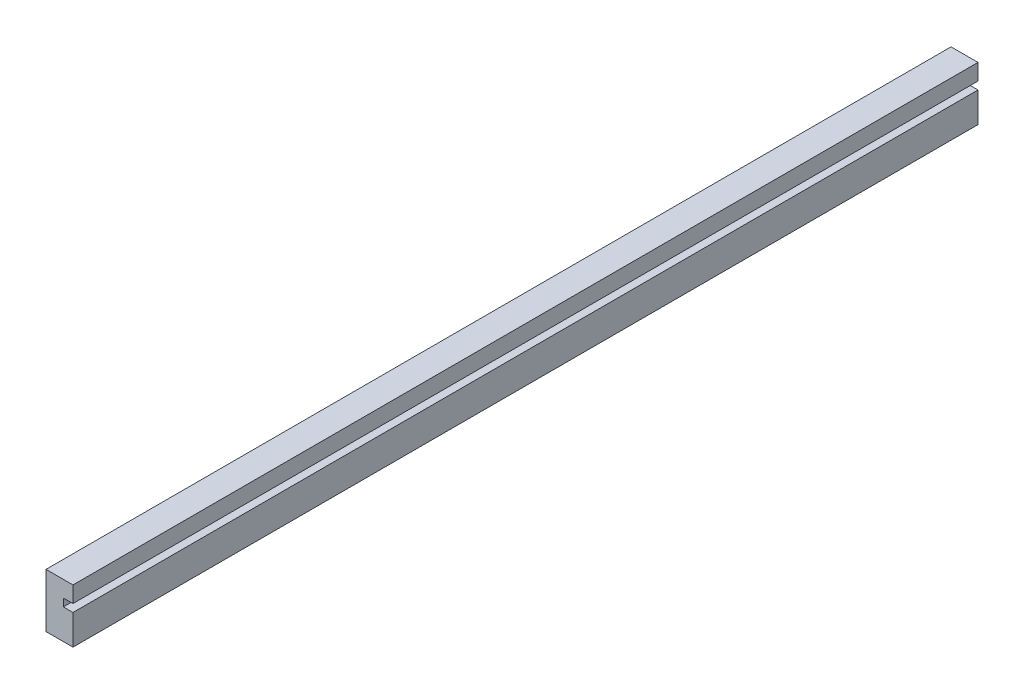
ISO-10303-21;
HEADER;
FILE_DESCRIPTION(('STEP AP214'),'2;1');
FILE_NAME('part.step','',(''),(''),'','','');
FILE_SCHEMA(('AUTOMOTIVE_DESIGN { 1 0 10303 214 1 1 1 1 }'));
ENDSEC;
DATA;
#1=APPLICATION_CONTEXT('core data for automotive mechanical design processes');
#2=APPLICATION_PROTOCOL_DEFINITION('international standard','automotive_design',2000,#1);
#3=PRODUCT_CONTEXT('',#1,'mechanical');
#4=PRODUCT('Part','Part','',(#3));
#5=PRODUCT_RELATED_PRODUCT_CATEGORY('part','',(#4));
#6=PRODUCT_DEFINITION_FORMATION('','',#4);
#7=PRODUCT_DEFINITION_CONTEXT('part definition',#1,'design');
#8=PRODUCT_DEFINITION('design','',#6,#7);
#9=PRODUCT_DEFINITION_SHAPE('','',#8);
#10=(LENGTH_UNIT() NAMED_UNIT(*) SI_UNIT(.MILLI.,.METRE.));
#11=(NAMED_UNIT(*) PLANE_ANGLE_UNIT() SI_UNIT($,.RADIAN.));
#12=(NAMED_UNIT(*) SI_UNIT($,.STERADIAN.) SOLID_ANGLE_UNIT());
#13=UNCERTAINTY_MEASURE_WITH_UNIT(LENGTH_MEASURE(1.E-05),#10,'distance_accuracy_value','');
#14=(GEOMETRIC_REPRESENTATION_CONTEXT(3) GLOBAL_UNCERTAINTY_ASSIGNED_CONTEXT((#13)) GLOBAL_UNIT_ASSIGNED_CONTEXT((#10,
#11,#12)) REPRESENTATION_CONTEXT('',''));
#15=CARTESIAN_POINT('',(0.,0.,0.));
#16=DIRECTION('',(0.,0.,1.));
#17=DIRECTION('',(1.,0.,0.));
#18=AXIS2_PLACEMENT_3D('',#15,#16,#17);
#19=CARTESIAN_POINT('',(0.,7.,0.));
#20=DIRECTION('',(0.,1.,0.));
#21=DIRECTION('',(0.,0.,1.));
#22=AXIS2_PLACEMENT_3D('',#19,#20,#21);
#23=PLANE('',#22);
#24=CARTESIAN_POINT('',(-3.,7.,-212.5));
#25=DIRECTION('',(0.,1.,0.));
#26=DIRECTION('',(0.,0.,1.));
#27=AXIS2_PLACEMENT_3D('',#24,#25,#26);
#28=CIRCLE('',#27,1.2);
#29=CARTESIAN_POINT('',(-3.,7.,-211.3));
#30=VERTEX_POINT('',#29);
#31=EDGE_CURVE('E19',#30,#30,#28,.F.);
#32=ORIENTED_EDGE('',*,*,#31,.T.);
#33=EDGE_LOOP('',(#32));
#34=FACE_BOUND('',#33,.T.);
#35=ADVANCED_FACE('F16',(#34),#23,.F.);
#36=CARTESIAN_POINT('',(0.,7.,0.));
#37=DIRECTION('',(0.,1.,0.));
#38=DIRECTION('',(0.,0.,1.));
#39=AXIS2_PLACEMENT_3D('',#36,#37,#38);
#40=PLANE('',#39);
#41=CARTESIAN_POINT('',(-3.,7.,-122.5));
#42=DIRECTION('',(0.,1.,0.));
#43=DIRECTION('',(0.,0.,1.));
#44=AXIS2_PLACEMENT_3D('',#41,#42,#43);
#45=CIRCLE('',#44,1.2);
#46=CARTESIAN_POINT('',(-3.,7.,-121.3));
#47=VERTEX_POINT('',#46);
#48=EDGE_CURVE('E132',#47,#47,#45,.F.);
#49=ORIENTED_EDGE('',*,*,#48,.T.);
#50=EDGE_LOOP('',(#49));
#51=FACE_BOUND('',#50,.T.);
#52=ADVANCED_FACE('F311',(#51),#40,.F.);
#53=CARTESIAN_POINT('',(0.,7.,0.));
#54=DIRECTION('',(0.,1.,0.));
#55=DIRECTION('',(0.,0.,1.));
#56=AXIS2_PLACEMENT_3D('',#53,#54,#55);
#57=PLANE('',#56);
#58=CARTESIAN_POINT('',(-3.,7.,-32.5));
#59=DIRECTION('',(0.,1.,0.));
#60=DIRECTION('',(0.,0.,1.));
#61=AXIS2_PLACEMENT_3D('',#58,#59,#60);
#62=CIRCLE('',#61,1.2);
#63=CARTESIAN_POINT('',(-3.,7.,-31.3));
#64=VERTEX_POINT('',#63);
#65=EDGE_CURVE('E123',#64,#64,#62,.F.);
#66=ORIENTED_EDGE('',*,*,#65,.T.);
#67=EDGE_LOOP('',(#66));
#68=FACE_BOUND('',#67,.T.);
#69=ADVANCED_FACE('F144',(#68),#57,.F.);
#70=CARTESIAN_POINT('',(-3.,0.,-212.5));
#71=DIRECTION('',(0.,1.,0.));
#72=DIRECTION('',(0.,0.,1.));
#73=AXIS2_PLACEMENT_3D('',#70,#71,#72);
#74=CYLINDRICAL_SURFACE('',#73,1.2);
#75=ORIENTED_EDGE('',*,*,#31,.F.);
#76=EDGE_LOOP('',(#75));
#77=FACE_BOUND('',#76,.T.);
#78=CARTESIAN_POINT('',(-3.,0.,-212.5));
#79=DIRECTION('',(0.,1.,0.));
#80=DIRECTION('',(0.,0.,1.));
#81=AXIS2_PLACEMENT_3D('',#78,#79,#80);
#82=CIRCLE('',#81,1.2);
#83=CARTESIAN_POINT('',(-3.,0.,-211.3));
#84=VERTEX_POINT('',#83);
#85=EDGE_CURVE('E116',#84,#84,#82,.T.);
#86=ORIENTED_EDGE('',*,*,#85,.F.);
#87=EDGE_LOOP('',(#86));
#88=FACE_BOUND('',#87,.T.);
#89=ADVANCED_FACE('F140',(#77,#88),#74,.F.);
#90=CARTESIAN_POINT('',(-3.,0.,-122.5));
#91=DIRECTION('',(0.,1.,0.));
#92=DIRECTION('',(0.,0.,1.));
#93=AXIS2_PLACEMENT_3D('',#90,#91,#92);
#94=CYLINDRICAL_SURFACE('',#93,1.2);
#95=ORIENTED_EDGE('',*,*,#48,.F.);
#96=EDGE_LOOP('',(#95));
#97=FACE_BOUND('',#96,.T.);
#98=CARTESIAN_POINT('',(-3.,0.,-122.5));
#99=DIRECTION('',(0.,1.,0.));
#100=DIRECTION('',(0.,0.,1.));
#101=AXIS2_PLACEMENT_3D('',#98,#99,#100);
#102=CIRCLE('',#101,1.2);
#103=CARTESIAN_POINT('',(-3.,0.,-121.3));
#104=VERTEX_POINT('',#103);
#105=EDGE_CURVE('E126',#104,#104,#102,.T.);
#106=ORIENTED_EDGE('',*,*,#105,.F.);
#107=EDGE_LOOP('',(#106));
#108=FACE_BOUND('',#107,.T.);
#109=ADVANCED_FACE('F143',(#97,#108),#94,.F.);
#110=CARTESIAN_POINT('',(-3.,0.,-32.5));
#111=DIRECTION('',(0.,1.,0.));
#112=DIRECTION('',(0.,0.,1.));
#113=AXIS2_PLACEMENT_3D('',#110,#111,#112);
#114=CYLINDRICAL_SURFACE('',#113,1.2);
#115=ORIENTED_EDGE('',*,*,#65,.F.);
#116=EDGE_LOOP('',(#115));
#117=FACE_BOUND('',#116,.T.);
#118=CARTESIAN_POINT('',(-3.,0.,-32.5));
#119=DIRECTION('',(0.,1.,0.));
#120=DIRECTION('',(0.,0.,1.));
#121=AXIS2_PLACEMENT_3D('',#118,#119,#120);
#122=CIRCLE('',#121,1.2);
#123=CARTESIAN_POINT('',(-3.,0.,-31.3));
#124=VERTEX_POINT('',#123);
#125=EDGE_CURVE('E102',#124,#124,#122,.T.);
#126=ORIENTED_EDGE('',*,*,#125,.F.);
#127=EDGE_LOOP('',(#126));
#128=FACE_BOUND('',#127,.T.);
#129=ADVANCED_FACE('F206',(#117,#128),#114,.F.);
#130=CARTESIAN_POINT('',(0.,7.8,0.));
#131=DIRECTION('',(0.,1.,0.));
#132=DIRECTION('',(0.,0.,1.));
#133=AXIS2_PLACEMENT_3D('',#130,#131,#132);
#134=PLANE('',#133);
#135=DIRECTION('',(0.,0.,-1.));
#136=VECTOR('',#135,1.);
#137=CARTESIAN_POINT('',(0.,7.8,0.));
#138=LINE('',#137,#136);
#139=CARTESIAN_POINT('',(0.,7.8,-240.));
#140=VERTEX_POINT('',#139);
#141=CARTESIAN_POINT('',(0.,7.8,-5.));
#142=VERTEX_POINT('',#141);
#143=EDGE_CURVE('E94',#140,#142,#138,.F.);
#144=ORIENTED_EDGE('',*,*,#143,.F.);
#145=DIRECTION('',(1.,0.,0.));
#146=VECTOR('',#145,1.);
#147=CARTESIAN_POINT('',(0.,7.8,-240.));
#148=LINE('',#147,#146);
#149=CARTESIAN_POINT('',(-2.5,7.8,-240.));
#150=VERTEX_POINT('',#149);
#151=EDGE_CURVE('E184',#140,#150,#148,.F.);
#152=ORIENTED_EDGE('',*,*,#151,.T.);
#153=DIRECTION('',(0.,0.,-1.));
#154=VECTOR('',#153,1.);
#155=CARTESIAN_POINT('',(-2.5,7.8,0.));
#156=LINE('',#155,#154);
#157=CARTESIAN_POINT('',(-2.5,7.8,-5.));
#158=VERTEX_POINT('',#157);
#159=EDGE_CURVE('E120',#158,#150,#156,.T.);
#160=ORIENTED_EDGE('',*,*,#159,.F.);
#161=DIRECTION('',(-1.,0.,0.));
#162=VECTOR('',#161,1.);
#163=CARTESIAN_POINT('',(-7.,7.8,-5.));
#164=LINE('',#163,#162);
#165=EDGE_CURVE('E109',#158,#142,#164,.F.);
#166=ORIENTED_EDGE('',*,*,#165,.T.);
#167=EDGE_LOOP('',(#144,#152,#160,#166));
#168=FACE_BOUND('',#167,.T.);
#169=ADVANCED_FACE('F192',(#168),#134,.T.);
#170=CARTESIAN_POINT('',(-2.5,7.8,0.));
#171=DIRECTION('',(1.,0.,0.));
#172=DIRECTION('',(0.,0.,-1.));
#173=AXIS2_PLACEMENT_3D('',#170,#171,#172);
#174=PLANE('',#173);
#175=ORIENTED_EDGE('',*,*,#159,.T.);
#176=DIRECTION('',(0.,1.,0.));
#177=VECTOR('',#176,1.);
#178=CARTESIAN_POINT('',(-2.5,0.,-240.));
#179=LINE('',#178,#177);
#180=CARTESIAN_POINT('',(-2.5,9.8,-240.));
#181=VERTEX_POINT('',#180);
#182=EDGE_CURVE('E182',#150,#181,#179,.T.);
#183=ORIENTED_EDGE('',*,*,#182,.T.);
#184=DIRECTION('',(0.,0.,-1.));
#185=VECTOR('',#184,1.);
#186=CARTESIAN_POINT('',(-2.5,9.8,0.));
#187=LINE('',#186,#185);
#188=CARTESIAN_POINT('',(-2.5,9.8,-5.));
#189=VERTEX_POINT('',#188);
#190=EDGE_CURVE('E79',#189,#181,#187,.T.);
#191=ORIENTED_EDGE('',*,*,#190,.F.);
#192=DIRECTION('',(0.,1.,0.));
#193=VECTOR('',#192,1.);
#194=CARTESIAN_POINT('',(-2.5,0.,-5.));
#195=LINE('',#194,#193);
#196=EDGE_CURVE('E107',#189,#158,#195,.F.);
#197=ORIENTED_EDGE('',*,*,#196,.T.);
#198=EDGE_LOOP('',(#175,#183,#191,#197));
#199=FACE_BOUND('',#198,.T.);
#200=ADVANCED_FACE('F197',(#199),#174,.T.);
#201=CARTESIAN_POINT('',(-2.5,9.8,0.));
#202=DIRECTION('',(0.,-1.,0.));
#203=DIRECTION('',(0.,0.,-1.));
#204=AXIS2_PLACEMENT_3D('',#201,#202,#203);
#205=PLANE('',#204);
#206=ORIENTED_EDGE('',*,*,#190,.T.);
#207=DIRECTION('',(1.,0.,0.));
#208=VECTOR('',#207,1.);
#209=CARTESIAN_POINT('',(0.,9.8,-240.));
#210=LINE('',#209,#208);
#211=CARTESIAN_POINT('',(0.,9.8,-240.));
#212=VERTEX_POINT('',#211);
#213=EDGE_CURVE('E91',#181,#212,#210,.T.);
#214=ORIENTED_EDGE('',*,*,#213,.T.);
#215=DIRECTION('',(0.,0.,-1.));
#216=VECTOR('',#215,1.);
#217=CARTESIAN_POINT('',(0.,9.8,0.));
#218=LINE('',#217,#216);
#219=CARTESIAN_POINT('',(0.,9.8,-5.));
#220=VERTEX_POINT('',#219);
#221=EDGE_CURVE('E84',#220,#212,#218,.T.);
#222=ORIENTED_EDGE('',*,*,#221,.F.);
#223=DIRECTION('',(-1.,0.,0.));
#224=VECTOR('',#223,1.);
#225=CARTESIAN_POINT('',(-7.,9.8,-5.));
#226=LINE('',#225,#224);
#227=EDGE_CURVE('E88',#220,#189,#226,.T.);
#228=ORIENTED_EDGE('',*,*,#227,.T.);
#229=EDGE_LOOP('',(#206,#214,#222,#228));
#230=FACE_BOUND('',#229,.T.);
#231=ADVANCED_FACE('F86',(#230),#205,.T.);
#232=CARTESIAN_POINT('',(0.,9.8,0.));
#233=DIRECTION('',(1.,0.,0.));
#234=DIRECTION('',(0.,0.,-1.));
#235=AXIS2_PLACEMENT_3D('',#232,#233,#234);
#236=PLANE('',#235);
#237=ORIENTED_EDGE('',*,*,#221,.T.);
#238=DIRECTION('',(0.,1.,0.));
#239=VECTOR('',#238,1.);
#240=CARTESIAN_POINT('',(0.,0.,-240.));
#241=LINE('',#240,#239);
#242=CARTESIAN_POINT('',(0.,14.,-240.));
#243=VERTEX_POINT('',#242);
#244=EDGE_CURVE('E179',#212,#243,#241,.T.);
#245=ORIENTED_EDGE('',*,*,#244,.T.);
#246=DIRECTION('',(0.,0.,1.));
#247=VECTOR('',#246,1.);
#248=CARTESIAN_POINT('',(0.,14.,0.));
#249=LINE('',#248,#247);
#250=CARTESIAN_POINT('',(0.,14.,-5.));
#251=VERTEX_POINT('',#250);
#252=EDGE_CURVE('E99',#251,#243,#249,.F.);
#253=ORIENTED_EDGE('',*,*,#252,.F.);
#254=DIRECTION('',(0.,1.,0.));
#255=VECTOR('',#254,1.);
#256=CARTESIAN_POINT('',(0.,0.,-5.));
#257=LINE('',#256,#255);
#258=EDGE_CURVE('E97',#251,#220,#257,.F.);
#259=ORIENTED_EDGE('',*,*,#258,.T.);
#260=EDGE_LOOP('',(#237,#245,#253,#259));
#261=FACE_BOUND('',#260,.T.);
#262=ADVANCED_FACE('F98',(#261),#236,.T.);
#263=CARTESIAN_POINT('',(0.,0.,0.));
#264=DIRECTION('',(1.,0.,0.));
#265=DIRECTION('',(0.,0.,-1.));
#266=AXIS2_PLACEMENT_3D('',#263,#264,#265);
#267=PLANE('',#266);
#268=DIRECTION('',(0.,0.,-1.));
#269=VECTOR('',#268,1.);
#270=CARTESIAN_POINT('',(0.,0.,0.));
#271=LINE('',#270,#269);
#272=CARTESIAN_POINT('',(0.,0.,-240.));
#273=VERTEX_POINT('',#272);
#274=CARTESIAN_POINT('',(0.,0.,-5.));
#275=VERTEX_POINT('',#274);
#276=EDGE_CURVE('E113',#273,#275,#271,.F.);
#277=ORIENTED_EDGE('',*,*,#276,.F.);
#278=DIRECTION('',(0.,1.,0.));
#279=VECTOR('',#278,1.);
#280=CARTESIAN_POINT('',(0.,0.,-240.));
#281=LINE('',#280,#279);
#282=EDGE_CURVE('E165',#273,#140,#281,.T.);
#283=ORIENTED_EDGE('',*,*,#282,.T.);
#284=ORIENTED_EDGE('',*,*,#143,.T.);
#285=DIRECTION('',(0.,1.,0.));
#286=VECTOR('',#285,1.);
#287=CARTESIAN_POINT('',(0.,0.,-5.));
#288=LINE('',#287,#286);
#289=EDGE_CURVE('E190',#142,#275,#288,.F.);
#290=ORIENTED_EDGE('',*,*,#289,.T.);
#291=EDGE_LOOP('',(#277,#283,#284,#290));
#292=FACE_BOUND('',#291,.T.);
#293=ADVANCED_FACE('F151',(#292),#267,.T.);
#294=CARTESIAN_POINT('',(-7.,0.,0.));
#295=DIRECTION('',(0.,-1.,0.));
#296=DIRECTION('',(0.,0.,-1.));
#297=AXIS2_PLACEMENT_3D('',#294,#295,#296);
#298=PLANE('',#297);
#299=ORIENTED_EDGE('',*,*,#125,.T.);
#300=EDGE_LOOP('',(#299));
#301=FACE_BOUND('',#300,.T.);
#302=ORIENTED_EDGE('',*,*,#105,.T.);
#303=EDGE_LOOP('',(#302));
#304=FACE_BOUND('',#303,.T.);
#305=ORIENTED_EDGE('',*,*,#85,.T.);
#306=EDGE_LOOP('',(#305));
#307=FACE_BOUND('',#306,.T.);
#308=DIRECTION('',(0.,0.,1.));
#309=VECTOR('',#308,1.);
#310=CARTESIAN_POINT('',(-7.,0.,0.));
#311=LINE('',#310,#309);
#312=CARTESIAN_POINT('',(-7.,0.,-240.));
#313=VERTEX_POINT('',#312);
#314=CARTESIAN_POINT('',(-7.,0.,-5.));
#315=VERTEX_POINT('',#314);
#316=EDGE_CURVE('E156',#313,#315,#311,.T.);
#317=ORIENTED_EDGE('',*,*,#316,.F.);
#318=DIRECTION('',(1.,0.,0.));
#319=VECTOR('',#318,1.);
#320=CARTESIAN_POINT('',(0.,0.,-240.));
#321=LINE('',#320,#319);
#322=EDGE_CURVE('E158',#313,#273,#321,.T.);
#323=ORIENTED_EDGE('',*,*,#322,.T.);
#324=ORIENTED_EDGE('',*,*,#276,.T.);
#325=DIRECTION('',(-1.,0.,0.));
#326=VECTOR('',#325,1.);
#327=CARTESIAN_POINT('',(-7.,0.,-5.));
#328=LINE('',#327,#326);
#329=EDGE_CURVE('E160',#275,#315,#328,.T.);
#330=ORIENTED_EDGE('',*,*,#329,.T.);
#331=EDGE_LOOP('',(#317,#323,#324,#330));
#332=FACE_BOUND('',#331,.T.);
#333=ADVANCED_FACE('F148',(#301,#304,#307,#332),#298,.T.);
#334=CARTESIAN_POINT('',(-7.,0.,-5.));
#335=DIRECTION('',(0.,0.,-1.));
#336=DIRECTION('',(-1.,0.,0.));
#337=AXIS2_PLACEMENT_3D('',#334,#335,#336);
#338=PLANE('',#337);
#339=ORIENTED_EDGE('',*,*,#329,.F.);
#340=ORIENTED_EDGE('',*,*,#289,.F.);
#341=ORIENTED_EDGE('',*,*,#165,.F.);
#342=ORIENTED_EDGE('',*,*,#196,.F.);
#343=ORIENTED_EDGE('',*,*,#227,.F.);
#344=ORIENTED_EDGE('',*,*,#258,.F.);
#345=DIRECTION('',(1.,0.,0.));
#346=VECTOR('',#345,1.);
#347=CARTESIAN_POINT('',(0.,14.,-5.));
#348=LINE('',#347,#346);
#349=CARTESIAN_POINT('',(-7.,14.,-5.));
#350=VERTEX_POINT('',#349);
#351=EDGE_CURVE('E187',#350,#251,#348,.T.);
#352=ORIENTED_EDGE('',*,*,#351,.F.);
#353=DIRECTION('',(0.,1.,0.));
#354=VECTOR('',#353,1.);
#355=CARTESIAN_POINT('',(-7.,14.,-5.));
#356=LINE('',#355,#354);
#357=EDGE_CURVE('E164',#315,#350,#356,.T.);
#358=ORIENTED_EDGE('',*,*,#357,.F.);
#359=EDGE_LOOP('',(#339,#340,#341,#342,#343,#344,#352,#358));
#360=FACE_BOUND('',#359,.T.);
#361=ADVANCED_FACE('F105',(#360),#338,.F.);
#362=CARTESIAN_POINT('',(0.,14.,0.));
#363=DIRECTION('',(0.,1.,0.));
#364=DIRECTION('',(0.,0.,1.));
#365=AXIS2_PLACEMENT_3D('',#362,#363,#364);
#366=PLANE('',#365);
#367=ORIENTED_EDGE('',*,*,#252,.T.);
#368=DIRECTION('',(1.,0.,0.));
#369=VECTOR('',#368,1.);
#370=CARTESIAN_POINT('',(0.,14.,-240.));
#371=LINE('',#370,#369);
#372=CARTESIAN_POINT('',(-7.,14.,-240.));
#373=VERTEX_POINT('',#372);
#374=EDGE_CURVE('E34',#243,#373,#371,.F.);
#375=ORIENTED_EDGE('',*,*,#374,.T.);
#376=DIRECTION('',(0.,0.,1.));
#377=VECTOR('',#376,1.);
#378=CARTESIAN_POINT('',(-7.,14.,0.));
#379=LINE('',#378,#377);
#380=EDGE_CURVE('E25',#350,#373,#379,.F.);
#381=ORIENTED_EDGE('',*,*,#380,.F.);
#382=ORIENTED_EDGE('',*,*,#351,.T.);
#383=EDGE_LOOP('',(#367,#375,#381,#382));
#384=FACE_BOUND('',#383,.T.);
#385=ADVANCED_FACE('F195',(#384),#366,.T.);
#386=CARTESIAN_POINT('',(0.,0.,-240.));
#387=DIRECTION('',(0.,0.,1.));
#388=DIRECTION('',(1.,0.,0.));
#389=AXIS2_PLACEMENT_3D('',#386,#387,#388);
#390=PLANE('',#389);
#391=ORIENTED_EDGE('',*,*,#322,.F.);
#392=DIRECTION('',(0.,1.,0.));
#393=VECTOR('',#392,1.);
#394=CARTESIAN_POINT('',(-7.,14.,-240.));
#395=LINE('',#394,#393);
#396=EDGE_CURVE('E11',#373,#313,#395,.F.);
#397=ORIENTED_EDGE('',*,*,#396,.F.);
#398=ORIENTED_EDGE('',*,*,#374,.F.);
#399=ORIENTED_EDGE('',*,*,#244,.F.);
#400=ORIENTED_EDGE('',*,*,#213,.F.);
#401=ORIENTED_EDGE('',*,*,#182,.F.);
#402=ORIENTED_EDGE('',*,*,#151,.F.);
#403=ORIENTED_EDGE('',*,*,#282,.F.);
#404=EDGE_LOOP('',(#391,#397,#398,#399,#400,#401,#402,#403));
#405=FACE_BOUND('',#404,.T.);
#406=ADVANCED_FACE('F168',(#405),#390,.F.);
#407=CARTESIAN_POINT('',(-7.,14.,0.));
#408=DIRECTION('',(-1.,0.,0.));
#409=DIRECTION('',(0.,0.,1.));
#410=AXIS2_PLACEMENT_3D('',#407,#408,#409);
#411=PLANE('',#410);
#412=ORIENTED_EDGE('',*,*,#380,.T.);
#413=ORIENTED_EDGE('',*,*,#396,.T.);
#414=ORIENTED_EDGE('',*,*,#316,.T.);
#415=ORIENTED_EDGE('',*,*,#357,.T.);
#416=EDGE_LOOP('',(#412,#413,#414,#415));
#417=FACE_BOUND('',#416,.T.);
#418=ADVANCED_FACE('F173',(#417),#411,.T.);
#419=CLOSED_SHELL('',(#35,#52,#69,#89,#109,#129,#169,#200,#231,#262,#293,#333,#361,#385,#406,#418));
#420=MANIFOLD_SOLID_BREP('B1',#419);
#421=ADVANCED_BREP_SHAPE_REPRESENTATION('',(#18,#420),#14);
#422=SHAPE_DEFINITION_REPRESENTATION(#9,#421);
ENDSEC;
END-ISO-10303-21;
